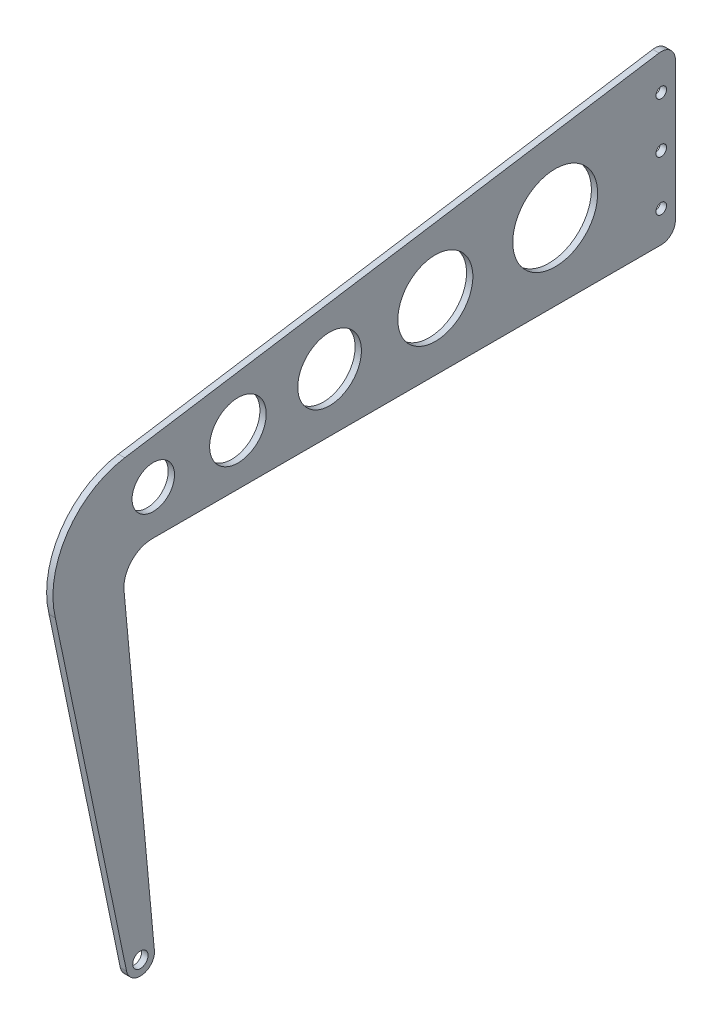
ISO-10303-21;
HEADER;
FILE_DESCRIPTION(('STEP AP214'),'2;1');
FILE_NAME('part.step','',(''),(''),'','','');
FILE_SCHEMA(('AUTOMOTIVE_DESIGN { 1 0 10303 214 1 1 1 1 }'));
ENDSEC;
DATA;
#1=APPLICATION_CONTEXT('core data for automotive mechanical design processes');
#2=APPLICATION_PROTOCOL_DEFINITION('international standard','automotive_design',2000,#1);
#3=PRODUCT_CONTEXT('',#1,'mechanical');
#4=PRODUCT('Part','Part','',(#3));
#5=PRODUCT_RELATED_PRODUCT_CATEGORY('part','',(#4));
#6=PRODUCT_DEFINITION_FORMATION('','',#4);
#7=PRODUCT_DEFINITION_CONTEXT('part definition',#1,'design');
#8=PRODUCT_DEFINITION('design','',#6,#7);
#9=PRODUCT_DEFINITION_SHAPE('','',#8);
#10=(LENGTH_UNIT() NAMED_UNIT(*) SI_UNIT(.MILLI.,.METRE.));
#11=(NAMED_UNIT(*) PLANE_ANGLE_UNIT() SI_UNIT($,.RADIAN.));
#12=(NAMED_UNIT(*) SI_UNIT($,.STERADIAN.) SOLID_ANGLE_UNIT());
#13=UNCERTAINTY_MEASURE_WITH_UNIT(LENGTH_MEASURE(1.E-05),#10,'distance_accuracy_value','');
#14=(GEOMETRIC_REPRESENTATION_CONTEXT(3) GLOBAL_UNCERTAINTY_ASSIGNED_CONTEXT((#13)) GLOBAL_UNIT_ASSIGNED_CONTEXT((#10,
#11,#12)) REPRESENTATION_CONTEXT('',''));
#15=CARTESIAN_POINT('',(0.,0.,0.));
#16=DIRECTION('',(0.,0.,1.));
#17=DIRECTION('',(1.,0.,0.));
#18=AXIS2_PLACEMENT_3D('',#15,#16,#17);
#19=CARTESIAN_POINT('',(0.,-362.675780874423,540.876124725459));
#20=DIRECTION('',(1.,0.,0.));
#21=DIRECTION('',(0.,0.,-1.));
#22=AXIS2_PLACEMENT_3D('',#19,#20,#21);
#23=CYLINDRICAL_SURFACE('',#22,14.3);
#24=CARTESIAN_POINT('',(6.35,-362.675780874423,540.876124725459));
#25=DIRECTION('',(1.,0.,0.));
#26=DIRECTION('',(0.,0.,-1.));
#27=AXIS2_PLACEMENT_3D('',#24,#25,#26);
#28=CIRCLE('',#27,14.3);
#29=CARTESIAN_POINT('',(6.35,-365.594764960311,554.875036536966));
#30=VERTEX_POINT('',#29);
#31=CARTESIAN_POINT('',(6.35,-359.756796788535,526.877212913953));
#32=VERTEX_POINT('',#31);
#33=EDGE_CURVE('E160',#30,#32,#28,.T.);
#34=ORIENTED_EDGE('',*,*,#33,.F.);
#35=DIRECTION('',(1.,0.,0.));
#36=VECTOR('',#35,1.);
#37=CARTESIAN_POINT('',(0.,-365.594764960311,554.875036536966));
#38=LINE('',#37,#36);
#39=CARTESIAN_POINT('',(0.,-365.594764960311,554.875036536966));
#40=VERTEX_POINT('',#39);
#41=EDGE_CURVE('E11',#40,#30,#38,.T.);
#42=ORIENTED_EDGE('',*,*,#41,.F.);
#43=CARTESIAN_POINT('',(0.,-362.675780874423,540.876124725459));
#44=DIRECTION('',(1.,0.,0.));
#45=DIRECTION('',(0.,0.,-1.));
#46=AXIS2_PLACEMENT_3D('',#43,#44,#45);
#47=CIRCLE('',#46,14.3);
#48=CARTESIAN_POINT('',(0.,-359.756796788535,526.877212913953));
#49=VERTEX_POINT('',#48);
#50=EDGE_CURVE('E197',#40,#49,#47,.T.);
#51=ORIENTED_EDGE('',*,*,#50,.T.);
#52=DIRECTION('',(1.,0.,0.));
#53=VECTOR('',#52,1.);
#54=CARTESIAN_POINT('',(0.,-359.756796788535,526.877212913953));
#55=LINE('',#54,#53);
#56=EDGE_CURVE('E48',#49,#32,#55,.T.);
#57=ORIENTED_EDGE('',*,*,#56,.T.);
#58=EDGE_LOOP('',(#34,#42,#51,#57));
#59=FACE_BOUND('',#58,.T.);
#60=ADVANCED_FACE('F45',(#59),#23,.T.);
#61=CARTESIAN_POINT('',(0.,-20.43228948417,626.846614508652));
#62=DIRECTION('',(0.,-0.204124761250914,0.978944881923521));
#63=DIRECTION('',(0.,-0.978944881923521,-0.204124761250915));
#64=AXIS2_PLACEMENT_3D('',#61,#62,#63);
#65=PLANE('',#64);
#66=DIRECTION('',(0.,-0.978944881923521,-0.204124761250914));
#67=VECTOR('',#66,1.);
#68=CARTESIAN_POINT('',(6.35,-20.43228948417,626.846614508652));
#69=LINE('',#68,#67);
#70=CARTESIAN_POINT('',(6.35,-20.43228948417,626.846614508652));
#71=VERTEX_POINT('',#70);
#72=EDGE_CURVE('E194',#71,#30,#69,.T.);
#73=ORIENTED_EDGE('',*,*,#72,.F.);
#74=DIRECTION('',(1.,0.,0.));
#75=VECTOR('',#74,1.);
#76=CARTESIAN_POINT('',(0.,-20.43228948417,626.846614508652));
#77=LINE('',#76,#75);
#78=CARTESIAN_POINT('',(0.,-20.43228948417,626.846614508652));
#79=VERTEX_POINT('',#78);
#80=EDGE_CURVE('E55',#79,#71,#77,.T.);
#81=ORIENTED_EDGE('',*,*,#80,.F.);
#82=DIRECTION('',(0.,-0.978944881923521,-0.204124761250914));
#83=VECTOR('',#82,1.);
#84=CARTESIAN_POINT('',(0.,-20.43228948417,626.846614508652));
#85=LINE('',#84,#83);
#86=EDGE_CURVE('E146',#79,#40,#85,.T.);
#87=ORIENTED_EDGE('',*,*,#86,.T.);
#88=ORIENTED_EDGE('',*,*,#41,.T.);
#89=EDGE_LOOP('',(#73,#81,#87,#88));
#90=FACE_BOUND('',#89,.T.);
#91=ADVANCED_FACE('F221',(#90),#65,.T.);
#92=CARTESIAN_POINT('',(0.,0.,543.498900278924));
#93=DIRECTION('',(1.,0.,0.));
#94=DIRECTION('',(0.,0.,-1.));
#95=AXIS2_PLACEMENT_3D('',#92,#93,#94);
#96=CYLINDRICAL_SURFACE('',#95,85.8156158335145);
#97=CARTESIAN_POINT('',(6.35,0.,543.498900278924));
#98=DIRECTION('',(1.,0.,0.));
#99=DIRECTION('',(0.,0.,-1.));
#100=AXIS2_PLACEMENT_3D('',#97,#98,#99);
#101=CIRCLE('',#100,85.8156158335145);
#102=CARTESIAN_POINT('',(6.35,84.7902805810614,556.724944278178));
#103=VERTEX_POINT('',#102);
#104=EDGE_CURVE('E132',#103,#71,#101,.T.);
#105=ORIENTED_EDGE('',*,*,#104,.F.);
#106=DIRECTION('',(1.,0.,0.));
#107=VECTOR('',#106,1.);
#108=CARTESIAN_POINT('',(0.,84.7902805810614,556.724944278178));
#109=LINE('',#108,#107);
#110=CARTESIAN_POINT('',(0.,84.7902805810614,556.724944278178));
#111=VERTEX_POINT('',#110);
#112=EDGE_CURVE('E127',#111,#103,#109,.T.);
#113=ORIENTED_EDGE('',*,*,#112,.F.);
#114=CARTESIAN_POINT('',(0.,0.,543.498900278924));
#115=DIRECTION('',(1.,0.,0.));
#116=DIRECTION('',(0.,0.,-1.));
#117=AXIS2_PLACEMENT_3D('',#114,#115,#116);
#118=CIRCLE('',#117,85.8156158335145);
#119=EDGE_CURVE('E130',#111,#79,#118,.T.);
#120=ORIENTED_EDGE('',*,*,#119,.T.);
#121=ORIENTED_EDGE('',*,*,#80,.T.);
#122=EDGE_LOOP('',(#105,#113,#120,#121));
#123=FACE_BOUND('',#122,.T.);
#124=ADVANCED_FACE('F129',(#123),#96,.T.);
#125=CARTESIAN_POINT('',(0.,169.056389869654,16.5069433054613));
#126=DIRECTION('',(0.,0.988051880272675,0.154121646401897));
#127=DIRECTION('',(0.,-0.154121646401897,0.988051880272675));
#128=AXIS2_PLACEMENT_3D('',#125,#126,#127);
#129=PLANE('',#128);
#130=DIRECTION('',(0.,-0.154121646401897,0.988051880272675));
#131=VECTOR('',#130,1.);
#132=CARTESIAN_POINT('',(6.35,169.056389869654,16.5069433054613));
#133=LINE('',#132,#131);
#134=CARTESIAN_POINT('',(6.35,169.056389869654,16.5069433054613));
#135=VERTEX_POINT('',#134);
#136=EDGE_CURVE('E189',#135,#103,#133,.T.);
#137=ORIENTED_EDGE('',*,*,#136,.F.);
#138=DIRECTION('',(1.,0.,0.));
#139=VECTOR('',#138,1.);
#140=CARTESIAN_POINT('',(0.,169.056389869654,16.5069433054613));
#141=LINE('',#140,#139);
#142=CARTESIAN_POINT('',(0.,169.056389869654,16.5069433054613));
#143=VERTEX_POINT('',#142);
#144=EDGE_CURVE('E138',#143,#135,#141,.T.);
#145=ORIENTED_EDGE('',*,*,#144,.F.);
#146=DIRECTION('',(0.,-0.154121646401897,0.988051880272675));
#147=VECTOR('',#146,1.);
#148=CARTESIAN_POINT('',(0.,169.056389869654,16.5069433054613));
#149=LINE('',#148,#147);
#150=EDGE_CURVE('E144',#143,#111,#149,.T.);
#151=ORIENTED_EDGE('',*,*,#150,.T.);
#152=ORIENTED_EDGE('',*,*,#112,.T.);
#153=EDGE_LOOP('',(#137,#145,#151,#152));
#154=FACE_BOUND('',#153,.T.);
#155=ADVANCED_FACE('F149',(#154),#129,.T.);
#156=CARTESIAN_POINT('',(0.,154.924676439477,14.302602638919));
#157=DIRECTION('',(1.,0.,0.));
#158=DIRECTION('',(0.,0.,-1.));
#159=AXIS2_PLACEMENT_3D('',#156,#157,#158);
#160=CYLINDRICAL_SURFACE('',#159,14.3026026389191);
#161=CARTESIAN_POINT('',(6.35,154.924676439477,14.302602638919));
#162=DIRECTION('',(1.,0.,0.));
#163=DIRECTION('',(0.,0.,-1.));
#164=AXIS2_PLACEMENT_3D('',#161,#162,#163);
#165=CIRCLE('',#164,14.3026026389191);
#166=CARTESIAN_POINT('',(6.35,154.924676439477,0.));
#167=VERTEX_POINT('',#166);
#168=EDGE_CURVE('E185',#167,#135,#165,.T.);
#169=ORIENTED_EDGE('',*,*,#168,.F.);
#170=DIRECTION('',(1.,0.,0.));
#171=VECTOR('',#170,1.);
#172=CARTESIAN_POINT('',(0.,154.924676439477,0.));
#173=LINE('',#172,#171);
#174=CARTESIAN_POINT('',(0.,154.924676439477,0.));
#175=VERTEX_POINT('',#174);
#176=EDGE_CURVE('E203',#175,#167,#173,.T.);
#177=ORIENTED_EDGE('',*,*,#176,.F.);
#178=CARTESIAN_POINT('',(0.,154.924676439477,14.302602638919));
#179=DIRECTION('',(1.,0.,0.));
#180=DIRECTION('',(0.,0.,-1.));
#181=AXIS2_PLACEMENT_3D('',#178,#179,#180);
#182=CIRCLE('',#181,14.3026026389191);
#183=EDGE_CURVE('E151',#175,#143,#182,.T.);
#184=ORIENTED_EDGE('',*,*,#183,.T.);
#185=ORIENTED_EDGE('',*,*,#144,.T.);
#186=EDGE_LOOP('',(#169,#177,#184,#185));
#187=FACE_BOUND('',#186,.T.);
#188=ADVANCED_FACE('F234',(#187),#160,.T.);
#189=CARTESIAN_POINT('',(0.,14.302602638919,0.));
#190=DIRECTION('',(0.,0.,-1.));
#191=DIRECTION('',(-1.,0.,0.));
#192=AXIS2_PLACEMENT_3D('',#189,#190,#191);
#193=PLANE('',#192);
#194=DIRECTION('',(0.,1.,0.));
#195=VECTOR('',#194,1.);
#196=CARTESIAN_POINT('',(6.35,14.302602638919,0.));
#197=LINE('',#196,#195);
#198=CARTESIAN_POINT('',(6.35,14.302602638919,0.));
#199=VERTEX_POINT('',#198);
#200=EDGE_CURVE('E181',#199,#167,#197,.T.);
#201=ORIENTED_EDGE('',*,*,#200,.F.);
#202=DIRECTION('',(1.,0.,0.));
#203=VECTOR('',#202,1.);
#204=CARTESIAN_POINT('',(0.,14.302602638919,0.));
#205=LINE('',#204,#203);
#206=CARTESIAN_POINT('',(0.,14.302602638919,0.));
#207=VERTEX_POINT('',#206);
#208=EDGE_CURVE('E206',#207,#199,#205,.T.);
#209=ORIENTED_EDGE('',*,*,#208,.F.);
#210=DIRECTION('',(0.,1.,0.));
#211=VECTOR('',#210,1.);
#212=CARTESIAN_POINT('',(0.,14.302602638919,0.));
#213=LINE('',#212,#211);
#214=EDGE_CURVE('E154',#207,#175,#213,.T.);
#215=ORIENTED_EDGE('',*,*,#214,.T.);
#216=ORIENTED_EDGE('',*,*,#176,.T.);
#217=EDGE_LOOP('',(#201,#209,#215,#216));
#218=FACE_BOUND('',#217,.T.);
#219=ADVANCED_FACE('F237',(#218),#193,.T.);
#220=CARTESIAN_POINT('',(0.,14.302602638919,14.302602638919));
#221=DIRECTION('',(1.,0.,0.));
#222=DIRECTION('',(0.,0.,-1.));
#223=AXIS2_PLACEMENT_3D('',#220,#221,#222);
#224=CYLINDRICAL_SURFACE('',#223,14.302602638919);
#225=CARTESIAN_POINT('',(6.35,14.302602638919,14.302602638919));
#226=DIRECTION('',(1.,0.,0.));
#227=DIRECTION('',(0.,0.,-1.));
#228=AXIS2_PLACEMENT_3D('',#225,#226,#227);
#229=CIRCLE('',#228,14.302602638919);
#230=CARTESIAN_POINT('',(6.35,0.,14.3026026389191));
#231=VERTEX_POINT('',#230);
#232=EDGE_CURVE('E177',#231,#199,#229,.T.);
#233=ORIENTED_EDGE('',*,*,#232,.F.);
#234=DIRECTION('',(1.,0.,0.));
#235=VECTOR('',#234,1.);
#236=CARTESIAN_POINT('',(0.,0.,14.3026026389191));
#237=LINE('',#236,#235);
#238=CARTESIAN_POINT('',(0.,0.,14.3026026389191));
#239=VERTEX_POINT('',#238);
#240=EDGE_CURVE('E209',#239,#231,#237,.T.);
#241=ORIENTED_EDGE('',*,*,#240,.F.);
#242=CARTESIAN_POINT('',(0.,14.302602638919,14.302602638919));
#243=DIRECTION('',(1.,0.,0.));
#244=DIRECTION('',(0.,0.,-1.));
#245=AXIS2_PLACEMENT_3D('',#242,#243,#244);
#246=CIRCLE('',#245,14.302602638919);
#247=EDGE_CURVE('E389',#239,#207,#246,.T.);
#248=ORIENTED_EDGE('',*,*,#247,.T.);
#249=ORIENTED_EDGE('',*,*,#208,.T.);
#250=EDGE_LOOP('',(#233,#241,#248,#249));
#251=FACE_BOUND('',#250,.T.);
#252=ADVANCED_FACE('F241',(#251),#224,.T.);
#253=CARTESIAN_POINT('',(0.,0.,528.91676230148));
#254=DIRECTION('',(0.,-1.,0.));
#255=DIRECTION('',(0.,0.,-1.));
#256=AXIS2_PLACEMENT_3D('',#253,#254,#255);
#257=PLANE('',#256);
#258=DIRECTION('',(0.,0.,-1.));
#259=VECTOR('',#258,1.);
#260=CARTESIAN_POINT('',(6.35,0.,528.91676230148));
#261=LINE('',#260,#259);
#262=CARTESIAN_POINT('',(6.35,0.,528.91676230148));
#263=VERTEX_POINT('',#262);
#264=EDGE_CURVE('E173',#263,#231,#261,.T.);
#265=ORIENTED_EDGE('',*,*,#264,.F.);
#266=DIRECTION('',(1.,0.,0.));
#267=VECTOR('',#266,1.);
#268=CARTESIAN_POINT('',(0.,0.,528.91676230148));
#269=LINE('',#268,#267);
#270=CARTESIAN_POINT('',(0.,0.,528.91676230148));
#271=VERTEX_POINT('',#270);
#272=EDGE_CURVE('E212',#271,#263,#269,.T.);
#273=ORIENTED_EDGE('',*,*,#272,.F.);
#274=DIRECTION('',(0.,0.,-1.));
#275=VECTOR('',#274,1.);
#276=CARTESIAN_POINT('',(0.,0.,528.91676230148));
#277=LINE('',#276,#275);
#278=EDGE_CURVE('E385',#271,#239,#277,.T.);
#279=ORIENTED_EDGE('',*,*,#278,.T.);
#280=ORIENTED_EDGE('',*,*,#240,.T.);
#281=EDGE_LOOP('',(#265,#273,#279,#280));
#282=FACE_BOUND('',#281,.T.);
#283=ADVANCED_FACE('F245',(#282),#257,.T.);
#284=CARTESIAN_POINT('',(0.,-28.6052052778381,528.91676230148));
#285=DIRECTION('',(1.,0.,0.));
#286=DIRECTION('',(0.,0.,-1.));
#287=AXIS2_PLACEMENT_3D('',#284,#285,#286);
#288=CYLINDRICAL_SURFACE('',#287,28.6052052778381);
#289=CARTESIAN_POINT('',(6.35,-28.6052052778381,528.91676230148));
#290=DIRECTION('',(-1.,0.,0.));
#291=DIRECTION('',(0.,0.,1.));
#292=AXIS2_PLACEMENT_3D('',#289,#290,#291);
#293=CIRCLE('',#292,28.6052052778381);
#294=CARTESIAN_POINT('',(6.35,-31.5952634269862,557.365265271794));
#295=VERTEX_POINT('',#294);
#296=EDGE_CURVE('E169',#295,#263,#293,.T.);
#297=ORIENTED_EDGE('',*,*,#296,.F.);
#298=DIRECTION('',(1.,0.,0.));
#299=VECTOR('',#298,1.);
#300=CARTESIAN_POINT('',(0.,-31.5952634269862,557.365265271794));
#301=LINE('',#300,#299);
#302=CARTESIAN_POINT('',(0.,-31.5952634269862,557.365265271794));
#303=VERTEX_POINT('',#302);
#304=EDGE_CURVE('E214',#303,#295,#301,.T.);
#305=ORIENTED_EDGE('',*,*,#304,.F.);
#306=CARTESIAN_POINT('',(0.,-28.6052052778381,528.91676230148));
#307=DIRECTION('',(-1.,0.,0.));
#308=DIRECTION('',(0.,0.,1.));
#309=AXIS2_PLACEMENT_3D('',#306,#307,#308);
#310=CIRCLE('',#309,28.6052052778381);
#311=EDGE_CURVE('E381',#303,#271,#310,.T.);
#312=ORIENTED_EDGE('',*,*,#311,.T.);
#313=ORIENTED_EDGE('',*,*,#272,.T.);
#314=EDGE_LOOP('',(#297,#305,#312,#313));
#315=FACE_BOUND('',#314,.T.);
#316=ADVANCED_FACE('F249',(#315),#288,.F.);
#317=CARTESIAN_POINT('',(0.,-31.5952634269862,557.365265271794));
#318=DIRECTION('',(0.,0.0925072467229278,-0.995712011228017));
#319=DIRECTION('',(0.,0.995712011228018,0.0925072467229278));
#320=AXIS2_PLACEMENT_3D('',#317,#318,#319);
#321=PLANE('',#320);
#322=DIRECTION('',(0.,0.995712011228017,0.0925072467229278));
#323=VECTOR('',#322,1.);
#324=CARTESIAN_POINT('',(6.35,-31.5952634269862,557.365265271794));
#325=LINE('',#324,#323);
#326=EDGE_CURVE('E164',#32,#295,#325,.T.);
#327=ORIENTED_EDGE('',*,*,#326,.F.);
#328=ORIENTED_EDGE('',*,*,#56,.F.);
#329=DIRECTION('',(0.,0.995712011228017,0.0925072467229278));
#330=VECTOR('',#329,1.);
#331=CARTESIAN_POINT('',(0.,-31.5952634269862,557.365265271794));
#332=LINE('',#331,#330);
#333=EDGE_CURVE('E378',#49,#303,#332,.T.);
#334=ORIENTED_EDGE('',*,*,#333,.T.);
#335=ORIENTED_EDGE('',*,*,#304,.T.);
#336=EDGE_LOOP('',(#327,#328,#334,#335));
#337=FACE_BOUND('',#336,.T.);
#338=ADVANCED_FACE('F218',(#337),#321,.T.);
#339=CARTESIAN_POINT('',(0.,-362.675780874423,540.876124725459));
#340=DIRECTION('',(1.,0.,0.));
#341=DIRECTION('',(0.,0.,-1.));
#342=AXIS2_PLACEMENT_3D('',#339,#340,#341);
#343=PLANE('',#342);
#344=CARTESIAN_POINT('',(0.,-362.675780874423,540.876124725459));
#345=DIRECTION('',(1.,0.,0.));
#346=DIRECTION('',(0.,0.,1.));
#347=AXIS2_PLACEMENT_3D('',#344,#345,#346);
#348=CIRCLE('',#347,7.72178730427252);
#349=CARTESIAN_POINT('',(0.,-362.675780874423,548.597912029732));
#350=VERTEX_POINT('',#349);
#351=EDGE_CURVE('E304',#350,#350,#348,.T.);
#352=ORIENTED_EDGE('',*,*,#351,.T.);
#353=EDGE_LOOP('',(#352));
#354=FACE_BOUND('',#353,.T.);
#355=CARTESIAN_POINT('',(0.,31.75,14.3026026389191));
#356=DIRECTION('',(1.,0.,0.));
#357=DIRECTION('',(0.,0.,1.));
#358=AXIS2_PLACEMENT_3D('',#355,#356,#357);
#359=CIRCLE('',#358,5.36347598959464);
#360=CARTESIAN_POINT('',(0.,31.75,19.6660786285137));
#361=VERTEX_POINT('',#360);
#362=EDGE_CURVE('E314',#361,#361,#359,.T.);
#363=ORIENTED_EDGE('',*,*,#362,.T.);
#364=EDGE_LOOP('',(#363));
#365=FACE_BOUND('',#364,.T.);
#366=CARTESIAN_POINT('',(0.,82.55,14.3026026389191));
#367=DIRECTION('',(1.,0.,0.));
#368=DIRECTION('',(0.,0.,1.));
#369=AXIS2_PLACEMENT_3D('',#366,#367,#368);
#370=CIRCLE('',#369,5.36347598959465);
#371=CARTESIAN_POINT('',(0.,82.55,19.6660786285137));
#372=VERTEX_POINT('',#371);
#373=EDGE_CURVE('E322',#372,#372,#370,.T.);
#374=ORIENTED_EDGE('',*,*,#373,.T.);
#375=EDGE_LOOP('',(#374));
#376=FACE_BOUND('',#375,.T.);
#377=CARTESIAN_POINT('',(0.,133.35,14.3026026389191));
#378=DIRECTION('',(1.,0.,0.));
#379=DIRECTION('',(0.,0.,1.));
#380=AXIS2_PLACEMENT_3D('',#377,#378,#379);
#381=CIRCLE('',#380,5.36347598959465);
#382=CARTESIAN_POINT('',(0.,133.35,19.6660786285137));
#383=VERTEX_POINT('',#382);
#384=EDGE_CURVE('E330',#383,#383,#381,.T.);
#385=ORIENTED_EDGE('',*,*,#384,.T.);
#386=EDGE_LOOP('',(#385));
#387=FACE_BOUND('',#386,.T.);
#388=CARTESIAN_POINT('',(0.,77.241415858326,121.484191711852));
#389=DIRECTION('',(1.,0.,0.));
#390=DIRECTION('',(0.,0.,1.));
#391=AXIS2_PLACEMENT_3D('',#388,#389,#390);
#392=CIRCLE('',#391,42.9078079167572);
#393=CARTESIAN_POINT('',(0.,77.241415858326,164.391999628609));
#394=VERTEX_POINT('',#393);
#395=EDGE_CURVE('E338',#394,#394,#392,.T.);
#396=ORIENTED_EDGE('',*,*,#395,.T.);
#397=EDGE_LOOP('',(#396));
#398=FACE_BOUND('',#397,.T.);
#399=CARTESIAN_POINT('',(0.,67.5469874726892,242.66917019767));
#400=DIRECTION('',(1.,0.,0.));
#401=DIRECTION('',(0.,0.,1.));
#402=AXIS2_PLACEMENT_3D('',#399,#400,#401);
#403=CIRCLE('',#402,37.9018969931355);
#404=CARTESIAN_POINT('',(0.,67.5469874726892,280.571067190805));
#405=VERTEX_POINT('',#404);
#406=EDGE_CURVE('E346',#405,#405,#403,.T.);
#407=ORIENTED_EDGE('',*,*,#406,.T.);
#408=EDGE_LOOP('',(#407));
#409=FACE_BOUND('',#408,.T.);
#410=CARTESIAN_POINT('',(0.,58.993080073598,349.597092391038));
#411=DIRECTION('',(1.,0.,0.));
#412=DIRECTION('',(0.,0.,1.));
#413=AXIS2_PLACEMENT_3D('',#410,#411,#412);
#414=CIRCLE('',#413,32.1808559375679);
#415=CARTESIAN_POINT('',(0.,58.993080073598,381.777948328606));
#416=VERTEX_POINT('',#415);
#417=EDGE_CURVE('E354',#416,#416,#414,.T.);
#418=ORIENTED_EDGE('',*,*,#417,.T.);
#419=EDGE_LOOP('',(#418));
#420=FACE_BOUND('',#419,.T.);
#421=CARTESIAN_POINT('',(0.,51.5796936610523,442.267958291958));
#422=DIRECTION('',(1.,0.,0.));
#423=DIRECTION('',(0.,0.,1.));
#424=AXIS2_PLACEMENT_3D('',#421,#422,#423);
#425=CIRCLE('',#424,28.6052052778381);
#426=CARTESIAN_POINT('',(0.,51.5796936610523,470.873163569796));
#427=VERTEX_POINT('',#426);
#428=EDGE_CURVE('E362',#427,#427,#425,.T.);
#429=ORIENTED_EDGE('',*,*,#428,.T.);
#430=EDGE_LOOP('',(#429));
#431=FACE_BOUND('',#430,.T.);
#432=CARTESIAN_POINT('',(0.,44.7365677417793,527.810296046652));
#433=DIRECTION('',(1.,0.,0.));
#434=DIRECTION('',(0.,0.,1.));
#435=AXIS2_PLACEMENT_3D('',#432,#433,#434);
#436=CIRCLE('',#435,21.4539039583785);
#437=CARTESIAN_POINT('',(0.,44.7365677417793,549.26420000503));
#438=VERTEX_POINT('',#437);
#439=EDGE_CURVE('E165',#438,#438,#436,.T.);
#440=ORIENTED_EDGE('',*,*,#439,.T.);
#441=EDGE_LOOP('',(#440));
#442=FACE_BOUND('',#441,.T.);
#443=ORIENTED_EDGE('',*,*,#50,.F.);
#444=ORIENTED_EDGE('',*,*,#86,.F.);
#445=ORIENTED_EDGE('',*,*,#119,.F.);
#446=ORIENTED_EDGE('',*,*,#150,.F.);
#447=ORIENTED_EDGE('',*,*,#183,.F.);
#448=ORIENTED_EDGE('',*,*,#214,.F.);
#449=ORIENTED_EDGE('',*,*,#247,.F.);
#450=ORIENTED_EDGE('',*,*,#278,.F.);
#451=ORIENTED_EDGE('',*,*,#311,.F.);
#452=ORIENTED_EDGE('',*,*,#333,.F.);
#453=EDGE_LOOP('',(#443,#444,#445,#446,#447,#448,#449,#450,#451,#452));
#454=FACE_BOUND('',#453,.T.);
#455=ADVANCED_FACE('F142',(#354,#365,#376,#387,#398,#409,#420,#431,#442,#454),#343,.F.);
#456=CARTESIAN_POINT('',(6.35,-362.675780874423,540.876124725459));
#457=DIRECTION('',(1.,0.,0.));
#458=DIRECTION('',(0.,0.,-1.));
#459=AXIS2_PLACEMENT_3D('',#456,#457,#458);
#460=PLANE('',#459);
#461=CARTESIAN_POINT('',(6.35,-362.675780874423,540.876124725459));
#462=DIRECTION('',(1.,0.,0.));
#463=DIRECTION('',(0.,0.,1.));
#464=AXIS2_PLACEMENT_3D('',#461,#462,#463);
#465=CIRCLE('',#464,7.72178730427252);
#466=CARTESIAN_POINT('',(6.35,-362.675780874423,548.597912029732));
#467=VERTEX_POINT('',#466);
#468=EDGE_CURVE('E307',#467,#467,#465,.T.);
#469=ORIENTED_EDGE('',*,*,#468,.F.);
#470=EDGE_LOOP('',(#469));
#471=FACE_BOUND('',#470,.T.);
#472=CARTESIAN_POINT('',(6.35,31.75,14.3026026389191));
#473=DIRECTION('',(1.,0.,0.));
#474=DIRECTION('',(0.,0.,1.));
#475=AXIS2_PLACEMENT_3D('',#472,#473,#474);
#476=CIRCLE('',#475,5.36347598959464);
#477=CARTESIAN_POINT('',(6.35,31.75,19.6660786285137));
#478=VERTEX_POINT('',#477);
#479=EDGE_CURVE('E311',#478,#478,#476,.T.);
#480=ORIENTED_EDGE('',*,*,#479,.F.);
#481=EDGE_LOOP('',(#480));
#482=FACE_BOUND('',#481,.T.);
#483=CARTESIAN_POINT('',(6.35,82.55,14.3026026389191));
#484=DIRECTION('',(1.,0.,0.));
#485=DIRECTION('',(0.,0.,1.));
#486=AXIS2_PLACEMENT_3D('',#483,#484,#485);
#487=CIRCLE('',#486,5.36347598959465);
#488=CARTESIAN_POINT('',(6.35,82.55,19.6660786285137));
#489=VERTEX_POINT('',#488);
#490=EDGE_CURVE('E318',#489,#489,#487,.T.);
#491=ORIENTED_EDGE('',*,*,#490,.F.);
#492=EDGE_LOOP('',(#491));
#493=FACE_BOUND('',#492,.T.);
#494=CARTESIAN_POINT('',(6.35,133.35,14.3026026389191));
#495=DIRECTION('',(1.,0.,0.));
#496=DIRECTION('',(0.,0.,1.));
#497=AXIS2_PLACEMENT_3D('',#494,#495,#496);
#498=CIRCLE('',#497,5.36347598959465);
#499=CARTESIAN_POINT('',(6.35,133.35,19.6660786285137));
#500=VERTEX_POINT('',#499);
#501=EDGE_CURVE('E326',#500,#500,#498,.T.);
#502=ORIENTED_EDGE('',*,*,#501,.F.);
#503=EDGE_LOOP('',(#502));
#504=FACE_BOUND('',#503,.T.);
#505=CARTESIAN_POINT('',(6.35,77.241415858326,121.484191711852));
#506=DIRECTION('',(1.,0.,0.));
#507=DIRECTION('',(0.,0.,1.));
#508=AXIS2_PLACEMENT_3D('',#505,#506,#507);
#509=CIRCLE('',#508,42.9078079167572);
#510=CARTESIAN_POINT('',(6.35,77.241415858326,164.391999628609));
#511=VERTEX_POINT('',#510);
#512=EDGE_CURVE('E334',#511,#511,#509,.T.);
#513=ORIENTED_EDGE('',*,*,#512,.F.);
#514=EDGE_LOOP('',(#513));
#515=FACE_BOUND('',#514,.T.);
#516=CARTESIAN_POINT('',(6.35,67.5469874726892,242.66917019767));
#517=DIRECTION('',(1.,0.,0.));
#518=DIRECTION('',(0.,0.,1.));
#519=AXIS2_PLACEMENT_3D('',#516,#517,#518);
#520=CIRCLE('',#519,37.9018969931355);
#521=CARTESIAN_POINT('',(6.35,67.5469874726892,280.571067190805));
#522=VERTEX_POINT('',#521);
#523=EDGE_CURVE('E342',#522,#522,#520,.T.);
#524=ORIENTED_EDGE('',*,*,#523,.F.);
#525=EDGE_LOOP('',(#524));
#526=FACE_BOUND('',#525,.T.);
#527=CARTESIAN_POINT('',(6.35,58.993080073598,349.597092391038));
#528=DIRECTION('',(1.,0.,0.));
#529=DIRECTION('',(0.,0.,1.));
#530=AXIS2_PLACEMENT_3D('',#527,#528,#529);
#531=CIRCLE('',#530,32.1808559375679);
#532=CARTESIAN_POINT('',(6.35,58.993080073598,381.777948328606));
#533=VERTEX_POINT('',#532);
#534=EDGE_CURVE('E350',#533,#533,#531,.T.);
#535=ORIENTED_EDGE('',*,*,#534,.F.);
#536=EDGE_LOOP('',(#535));
#537=FACE_BOUND('',#536,.T.);
#538=CARTESIAN_POINT('',(6.35,51.5796936610523,442.267958291958));
#539=DIRECTION('',(1.,0.,0.));
#540=DIRECTION('',(0.,0.,1.));
#541=AXIS2_PLACEMENT_3D('',#538,#539,#540);
#542=CIRCLE('',#541,28.6052052778381);
#543=CARTESIAN_POINT('',(6.35,51.5796936610523,470.873163569796));
#544=VERTEX_POINT('',#543);
#545=EDGE_CURVE('E358',#544,#544,#542,.T.);
#546=ORIENTED_EDGE('',*,*,#545,.F.);
#547=EDGE_LOOP('',(#546));
#548=FACE_BOUND('',#547,.T.);
#549=CARTESIAN_POINT('',(6.35,44.7365677417793,527.810296046652));
#550=DIRECTION('',(1.,0.,0.));
#551=DIRECTION('',(0.,0.,1.));
#552=AXIS2_PLACEMENT_3D('',#549,#550,#551);
#553=CIRCLE('',#552,21.4539039583785);
#554=CARTESIAN_POINT('',(6.35,44.7365677417793,549.26420000503));
#555=VERTEX_POINT('',#554);
#556=EDGE_CURVE('E366',#555,#555,#553,.T.);
#557=ORIENTED_EDGE('',*,*,#556,.F.);
#558=EDGE_LOOP('',(#557));
#559=FACE_BOUND('',#558,.T.);
#560=ORIENTED_EDGE('',*,*,#33,.T.);
#561=ORIENTED_EDGE('',*,*,#326,.T.);
#562=ORIENTED_EDGE('',*,*,#296,.T.);
#563=ORIENTED_EDGE('',*,*,#264,.T.);
#564=ORIENTED_EDGE('',*,*,#232,.T.);
#565=ORIENTED_EDGE('',*,*,#200,.T.);
#566=ORIENTED_EDGE('',*,*,#168,.T.);
#567=ORIENTED_EDGE('',*,*,#136,.T.);
#568=ORIENTED_EDGE('',*,*,#104,.T.);
#569=ORIENTED_EDGE('',*,*,#72,.T.);
#570=EDGE_LOOP('',(#560,#561,#562,#563,#564,#565,#566,#567,#568,#569));
#571=FACE_BOUND('',#570,.T.);
#572=ADVANCED_FACE('F220',(#471,#482,#493,#504,#515,#526,#537,#548,#559,#571),#460,.T.);
#573=CARTESIAN_POINT('',(0.,44.7365677417793,527.810296046652));
#574=DIRECTION('',(1.,0.,0.));
#575=DIRECTION('',(0.,0.,-1.));
#576=AXIS2_PLACEMENT_3D('',#573,#574,#575);
#577=CYLINDRICAL_SURFACE('',#576,21.4539039583785);
#578=ORIENTED_EDGE('',*,*,#439,.F.);
#579=EDGE_LOOP('',(#578));
#580=FACE_BOUND('',#579,.T.);
#581=ORIENTED_EDGE('',*,*,#556,.T.);
#582=EDGE_LOOP('',(#581));
#583=FACE_BOUND('',#582,.T.);
#584=ADVANCED_FACE('F261',(#580,#583),#577,.F.);
#585=CARTESIAN_POINT('',(0.,51.5796936610523,442.267958291958));
#586=DIRECTION('',(1.,0.,0.));
#587=DIRECTION('',(0.,0.,-1.));
#588=AXIS2_PLACEMENT_3D('',#585,#586,#587);
#589=CYLINDRICAL_SURFACE('',#588,28.6052052778381);
#590=ORIENTED_EDGE('',*,*,#428,.F.);
#591=EDGE_LOOP('',(#590));
#592=FACE_BOUND('',#591,.T.);
#593=ORIENTED_EDGE('',*,*,#545,.T.);
#594=EDGE_LOOP('',(#593));
#595=FACE_BOUND('',#594,.T.);
#596=ADVANCED_FACE('F268',(#592,#595),#589,.F.);
#597=CARTESIAN_POINT('',(0.,58.993080073598,349.597092391038));
#598=DIRECTION('',(1.,0.,0.));
#599=DIRECTION('',(0.,0.,-1.));
#600=AXIS2_PLACEMENT_3D('',#597,#598,#599);
#601=CYLINDRICAL_SURFACE('',#600,32.1808559375679);
#602=ORIENTED_EDGE('',*,*,#417,.F.);
#603=EDGE_LOOP('',(#602));
#604=FACE_BOUND('',#603,.T.);
#605=ORIENTED_EDGE('',*,*,#534,.T.);
#606=EDGE_LOOP('',(#605));
#607=FACE_BOUND('',#606,.T.);
#608=ADVANCED_FACE('F272',(#604,#607),#601,.F.);
#609=CARTESIAN_POINT('',(0.,67.5469874726892,242.66917019767));
#610=DIRECTION('',(1.,0.,0.));
#611=DIRECTION('',(0.,0.,-1.));
#612=AXIS2_PLACEMENT_3D('',#609,#610,#611);
#613=CYLINDRICAL_SURFACE('',#612,37.9018969931355);
#614=ORIENTED_EDGE('',*,*,#406,.F.);
#615=EDGE_LOOP('',(#614));
#616=FACE_BOUND('',#615,.T.);
#617=ORIENTED_EDGE('',*,*,#523,.T.);
#618=EDGE_LOOP('',(#617));
#619=FACE_BOUND('',#618,.T.);
#620=ADVANCED_FACE('F276',(#616,#619),#613,.F.);
#621=CARTESIAN_POINT('',(0.,77.241415858326,121.484191711852));
#622=DIRECTION('',(1.,0.,0.));
#623=DIRECTION('',(0.,0.,-1.));
#624=AXIS2_PLACEMENT_3D('',#621,#622,#623);
#625=CYLINDRICAL_SURFACE('',#624,42.9078079167572);
#626=ORIENTED_EDGE('',*,*,#395,.F.);
#627=EDGE_LOOP('',(#626));
#628=FACE_BOUND('',#627,.T.);
#629=ORIENTED_EDGE('',*,*,#512,.T.);
#630=EDGE_LOOP('',(#629));
#631=FACE_BOUND('',#630,.T.);
#632=ADVANCED_FACE('F280',(#628,#631),#625,.F.);
#633=CARTESIAN_POINT('',(0.,133.35,14.3026026389191));
#634=DIRECTION('',(1.,0.,0.));
#635=DIRECTION('',(0.,0.,-1.));
#636=AXIS2_PLACEMENT_3D('',#633,#634,#635);
#637=CYLINDRICAL_SURFACE('',#636,5.36347598959465);
#638=ORIENTED_EDGE('',*,*,#384,.F.);
#639=EDGE_LOOP('',(#638));
#640=FACE_BOUND('',#639,.T.);
#641=ORIENTED_EDGE('',*,*,#501,.T.);
#642=EDGE_LOOP('',(#641));
#643=FACE_BOUND('',#642,.T.);
#644=ADVANCED_FACE('F284',(#640,#643),#637,.F.);
#645=CARTESIAN_POINT('',(0.,82.55,14.3026026389191));
#646=DIRECTION('',(1.,0.,0.));
#647=DIRECTION('',(0.,0.,-1.));
#648=AXIS2_PLACEMENT_3D('',#645,#646,#647);
#649=CYLINDRICAL_SURFACE('',#648,5.36347598959465);
#650=ORIENTED_EDGE('',*,*,#373,.F.);
#651=EDGE_LOOP('',(#650));
#652=FACE_BOUND('',#651,.T.);
#653=ORIENTED_EDGE('',*,*,#490,.T.);
#654=EDGE_LOOP('',(#653));
#655=FACE_BOUND('',#654,.T.);
#656=ADVANCED_FACE('F288',(#652,#655),#649,.F.);
#657=CARTESIAN_POINT('',(0.,31.75,14.3026026389191));
#658=DIRECTION('',(1.,0.,0.));
#659=DIRECTION('',(0.,0.,-1.));
#660=AXIS2_PLACEMENT_3D('',#657,#658,#659);
#661=CYLINDRICAL_SURFACE('',#660,5.36347598959464);
#662=ORIENTED_EDGE('',*,*,#362,.F.);
#663=EDGE_LOOP('',(#662));
#664=FACE_BOUND('',#663,.T.);
#665=ORIENTED_EDGE('',*,*,#479,.T.);
#666=EDGE_LOOP('',(#665));
#667=FACE_BOUND('',#666,.T.);
#668=ADVANCED_FACE('F292',(#664,#667),#661,.F.);
#669=CARTESIAN_POINT('',(0.,-362.675780874423,540.876124725459));
#670=DIRECTION('',(1.,0.,0.));
#671=DIRECTION('',(0.,0.,-1.));
#672=AXIS2_PLACEMENT_3D('',#669,#670,#671);
#673=CYLINDRICAL_SURFACE('',#672,7.72178730427252);
#674=ORIENTED_EDGE('',*,*,#351,.F.);
#675=EDGE_LOOP('',(#674));
#676=FACE_BOUND('',#675,.T.);
#677=ORIENTED_EDGE('',*,*,#468,.T.);
#678=EDGE_LOOP('',(#677));
#679=FACE_BOUND('',#678,.T.);
#680=ADVANCED_FACE('F296',(#676,#679),#673,.F.);
#681=CLOSED_SHELL('',(#60,#91,#124,#155,#188,#219,#252,#283,#316,#338,#455,#572,#584,#596,#608,
#620,#632,#644,#656,#668,#680));
#682=MANIFOLD_SOLID_BREP('B2',#681);
#683=ADVANCED_BREP_SHAPE_REPRESENTATION('',(#18,#682),#14);
#684=SHAPE_DEFINITION_REPRESENTATION(#9,#683);
ENDSEC;
END-ISO-10303-21;
